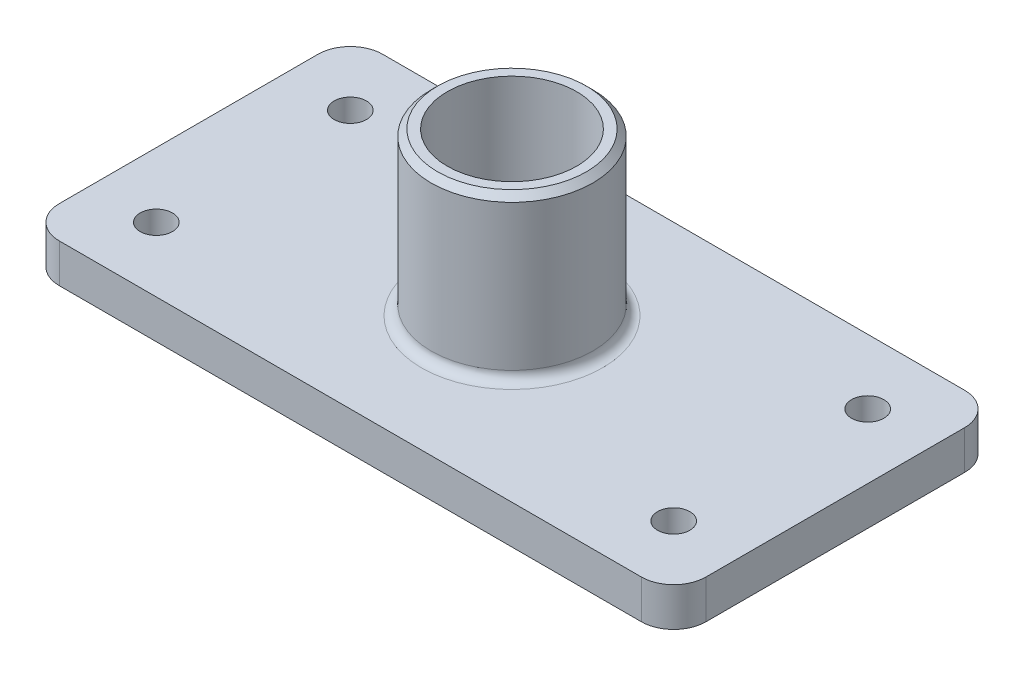
ISO-10303-21;
HEADER;
FILE_DESCRIPTION(('STEP AP214'),'2;1');
FILE_NAME('part.step','',(''),(''),'','','');
FILE_SCHEMA(('AUTOMOTIVE_DESIGN { 1 0 10303 214 1 1 1 1 }'));
ENDSEC;
DATA;
#1=APPLICATION_CONTEXT('core data for automotive mechanical design processes');
#2=APPLICATION_PROTOCOL_DEFINITION('international standard','automotive_design',2000,#1);
#3=PRODUCT_CONTEXT('',#1,'mechanical');
#4=PRODUCT('Part','Part','',(#3));
#5=PRODUCT_RELATED_PRODUCT_CATEGORY('part','',(#4));
#6=PRODUCT_DEFINITION_FORMATION('','',#4);
#7=PRODUCT_DEFINITION_CONTEXT('part definition',#1,'design');
#8=PRODUCT_DEFINITION('design','',#6,#7);
#9=PRODUCT_DEFINITION_SHAPE('','',#8);
#10=(LENGTH_UNIT() NAMED_UNIT(*) SI_UNIT(.MILLI.,.METRE.));
#11=(NAMED_UNIT(*) PLANE_ANGLE_UNIT() SI_UNIT($,.RADIAN.));
#12=(NAMED_UNIT(*) SI_UNIT($,.STERADIAN.) SOLID_ANGLE_UNIT());
#13=UNCERTAINTY_MEASURE_WITH_UNIT(LENGTH_MEASURE(1.E-05),#10,'distance_accuracy_value','');
#14=(GEOMETRIC_REPRESENTATION_CONTEXT(3) GLOBAL_UNCERTAINTY_ASSIGNED_CONTEXT((#13)) GLOBAL_UNIT_ASSIGNED_CONTEXT((#10,
#11,#12)) REPRESENTATION_CONTEXT('',''));
#15=CARTESIAN_POINT('',(0.,0.,0.));
#16=DIRECTION('',(0.,0.,1.));
#17=DIRECTION('',(1.,0.,0.));
#18=AXIS2_PLACEMENT_3D('',#15,#16,#17);
#19=CARTESIAN_POINT('',(90.,12.,40.));
#20=DIRECTION('',(0.,1.,0.));
#21=DIRECTION('',(0.,0.,1.));
#22=AXIS2_PLACEMENT_3D('',#19,#20,#21);
#23=PLANE('',#22);
#24=CARTESIAN_POINT('',(0.,12.,0.));
#25=DIRECTION('',(0.,1.,0.));
#26=DIRECTION('',(0.,0.,1.));
#27=AXIS2_PLACEMENT_3D('',#24,#25,#26);
#28=CIRCLE('',#27,28.);
#29=CARTESIAN_POINT('',(0.,12.,28.));
#30=VERTEX_POINT('',#29);
#31=EDGE_CURVE('E175',#30,#30,#28,.F.);
#32=ORIENTED_EDGE('',*,*,#31,.T.);
#33=EDGE_LOOP('',(#32));
#34=FACE_BOUND('',#33,.T.);
#35=CARTESIAN_POINT('',(80.,12.,30.));
#36=DIRECTION('',(0.,1.,0.));
#37=DIRECTION('',(0.,0.,1.));
#38=AXIS2_PLACEMENT_3D('',#35,#36,#37);
#39=CIRCLE('',#38,5.);
#40=CARTESIAN_POINT('',(80.,12.,35.));
#41=VERTEX_POINT('',#40);
#42=EDGE_CURVE('E265',#41,#41,#39,.T.);
#43=ORIENTED_EDGE('',*,*,#42,.F.);
#44=EDGE_LOOP('',(#43));
#45=FACE_BOUND('',#44,.T.);
#46=CARTESIAN_POINT('',(-80.,12.,-30.));
#47=DIRECTION('',(0.,1.,0.));
#48=DIRECTION('',(0.,0.,1.));
#49=AXIS2_PLACEMENT_3D('',#46,#47,#48);
#50=CIRCLE('',#49,4.99999999999999);
#51=CARTESIAN_POINT('',(-80.,12.,-25.));
#52=VERTEX_POINT('',#51);
#53=EDGE_CURVE('E253',#52,#52,#50,.T.);
#54=ORIENTED_EDGE('',*,*,#53,.F.);
#55=EDGE_LOOP('',(#54));
#56=FACE_BOUND('',#55,.T.);
#57=CARTESIAN_POINT('',(90.,12.,40.));
#58=DIRECTION('',(0.,1.,0.));
#59=DIRECTION('',(0.,0.,1.));
#60=AXIS2_PLACEMENT_3D('',#57,#58,#59);
#61=CIRCLE('',#60,10.);
#62=CARTESIAN_POINT('',(90.,12.,50.));
#63=VERTEX_POINT('',#62);
#64=CARTESIAN_POINT('',(100.,12.,40.));
#65=VERTEX_POINT('',#64);
#66=EDGE_CURVE('E157',#63,#65,#61,.T.);
#67=ORIENTED_EDGE('',*,*,#66,.T.);
#68=DIRECTION('',(0.,0.,-1.));
#69=VECTOR('',#68,1.);
#70=CARTESIAN_POINT('',(100.,12.,40.));
#71=LINE('',#70,#69);
#72=CARTESIAN_POINT('',(100.,12.,-40.));
#73=VERTEX_POINT('',#72);
#74=EDGE_CURVE('E105',#65,#73,#71,.T.);
#75=ORIENTED_EDGE('',*,*,#74,.T.);
#76=CARTESIAN_POINT('',(90.,12.,-40.));
#77=DIRECTION('',(0.,1.,0.));
#78=DIRECTION('',(0.,0.,-1.));
#79=AXIS2_PLACEMENT_3D('',#76,#77,#78);
#80=CIRCLE('',#79,9.99999999999998);
#81=CARTESIAN_POINT('',(90.,12.,-50.));
#82=VERTEX_POINT('',#81);
#83=EDGE_CURVE('E242',#73,#82,#80,.T.);
#84=ORIENTED_EDGE('',*,*,#83,.T.);
#85=DIRECTION('',(-1.,0.,0.));
#86=VECTOR('',#85,1.);
#87=CARTESIAN_POINT('',(-90.,12.,-50.));
#88=LINE('',#87,#86);
#89=CARTESIAN_POINT('',(-90.,12.,-50.));
#90=VERTEX_POINT('',#89);
#91=EDGE_CURVE('E244',#82,#90,#88,.T.);
#92=ORIENTED_EDGE('',*,*,#91,.T.);
#93=CARTESIAN_POINT('',(-90.,12.,-40.));
#94=DIRECTION('',(0.,1.,0.));
#95=DIRECTION('',(0.,0.,-1.));
#96=AXIS2_PLACEMENT_3D('',#93,#94,#95);
#97=CIRCLE('',#96,10.);
#98=CARTESIAN_POINT('',(-100.,12.,-40.));
#99=VERTEX_POINT('',#98);
#100=EDGE_CURVE('E124',#90,#99,#97,.T.);
#101=ORIENTED_EDGE('',*,*,#100,.T.);
#102=DIRECTION('',(0.,0.,1.));
#103=VECTOR('',#102,1.);
#104=CARTESIAN_POINT('',(-100.,12.,40.));
#105=LINE('',#104,#103);
#106=CARTESIAN_POINT('',(-100.,12.,40.));
#107=VERTEX_POINT('',#106);
#108=EDGE_CURVE('E118',#99,#107,#105,.T.);
#109=ORIENTED_EDGE('',*,*,#108,.T.);
#110=CARTESIAN_POINT('',(-90.,12.,40.));
#111=DIRECTION('',(0.,1.,0.));
#112=DIRECTION('',(0.,0.,-1.));
#113=AXIS2_PLACEMENT_3D('',#110,#111,#112);
#114=CIRCLE('',#113,10.);
#115=CARTESIAN_POINT('',(-90.,12.,50.));
#116=VERTEX_POINT('',#115);
#117=EDGE_CURVE('E122',#107,#116,#114,.T.);
#118=ORIENTED_EDGE('',*,*,#117,.T.);
#119=DIRECTION('',(1.,0.,0.));
#120=VECTOR('',#119,1.);
#121=CARTESIAN_POINT('',(-90.,12.,50.));
#122=LINE('',#121,#120);
#123=EDGE_CURVE('E61',#116,#63,#122,.T.);
#124=ORIENTED_EDGE('',*,*,#123,.T.);
#125=EDGE_LOOP('',(#67,#75,#84,#92,#101,#109,#118,#124));
#126=FACE_BOUND('',#125,.T.);
#127=CARTESIAN_POINT('',(-80.,12.,30.));
#128=DIRECTION('',(0.,1.,0.));
#129=DIRECTION('',(0.,0.,1.));
#130=AXIS2_PLACEMENT_3D('',#127,#128,#129);
#131=CIRCLE('',#130,4.99999999999999);
#132=CARTESIAN_POINT('',(-80.,12.,35.));
#133=VERTEX_POINT('',#132);
#134=EDGE_CURVE('E146',#133,#133,#131,.T.);
#135=ORIENTED_EDGE('',*,*,#134,.F.);
#136=EDGE_LOOP('',(#135));
#137=FACE_BOUND('',#136,.T.);
#138=CARTESIAN_POINT('',(80.,12.,-30.));
#139=DIRECTION('',(0.,1.,0.));
#140=DIRECTION('',(0.,0.,1.));
#141=AXIS2_PLACEMENT_3D('',#138,#139,#140);
#142=CIRCLE('',#141,5.);
#143=CARTESIAN_POINT('',(80.,12.,-25.));
#144=VERTEX_POINT('',#143);
#145=EDGE_CURVE('E259',#144,#144,#142,.T.);
#146=ORIENTED_EDGE('',*,*,#145,.F.);
#147=EDGE_LOOP('',(#146));
#148=FACE_BOUND('',#147,.T.);
#149=ADVANCED_FACE('F44',(#34,#45,#56,#126,#137,#148),#23,.T.);
#150=CARTESIAN_POINT('',(90.,0.,40.));
#151=DIRECTION('',(0.,1.,0.));
#152=DIRECTION('',(0.,0.,1.));
#153=AXIS2_PLACEMENT_3D('',#150,#151,#152);
#154=PLANE('',#153);
#155=CARTESIAN_POINT('',(0.,0.,0.));
#156=DIRECTION('',(0.,1.,0.));
#157=DIRECTION('',(0.,0.,1.));
#158=AXIS2_PLACEMENT_3D('',#155,#156,#157);
#159=CIRCLE('',#158,20.);
#160=CARTESIAN_POINT('',(0.,0.,20.));
#161=VERTEX_POINT('',#160);
#162=EDGE_CURVE('E271',#161,#161,#159,.T.);
#163=ORIENTED_EDGE('',*,*,#162,.T.);
#164=EDGE_LOOP('',(#163));
#165=FACE_BOUND('',#164,.T.);
#166=CARTESIAN_POINT('',(80.,0.,-30.));
#167=DIRECTION('',(0.,1.,0.));
#168=DIRECTION('',(0.,0.,1.));
#169=AXIS2_PLACEMENT_3D('',#166,#167,#168);
#170=CIRCLE('',#169,5.);
#171=CARTESIAN_POINT('',(80.,0.,-25.));
#172=VERTEX_POINT('',#171);
#173=EDGE_CURVE('E262',#172,#172,#170,.T.);
#174=ORIENTED_EDGE('',*,*,#173,.T.);
#175=EDGE_LOOP('',(#174));
#176=FACE_BOUND('',#175,.T.);
#177=CARTESIAN_POINT('',(-80.,0.,30.));
#178=DIRECTION('',(0.,1.,0.));
#179=DIRECTION('',(0.,0.,1.));
#180=AXIS2_PLACEMENT_3D('',#177,#178,#179);
#181=CIRCLE('',#180,4.99999999999999);
#182=CARTESIAN_POINT('',(-80.,0.,35.));
#183=VERTEX_POINT('',#182);
#184=EDGE_CURVE('E250',#183,#183,#181,.T.);
#185=ORIENTED_EDGE('',*,*,#184,.T.);
#186=EDGE_LOOP('',(#185));
#187=FACE_BOUND('',#186,.T.);
#188=CARTESIAN_POINT('',(90.,0.,40.));
#189=DIRECTION('',(0.,1.,0.));
#190=DIRECTION('',(0.,0.,1.));
#191=AXIS2_PLACEMENT_3D('',#188,#189,#190);
#192=CIRCLE('',#191,10.);
#193=CARTESIAN_POINT('',(90.,0.,50.));
#194=VERTEX_POINT('',#193);
#195=CARTESIAN_POINT('',(100.,0.,40.));
#196=VERTEX_POINT('',#195);
#197=EDGE_CURVE('E142',#194,#196,#192,.T.);
#198=ORIENTED_EDGE('',*,*,#197,.F.);
#199=DIRECTION('',(1.,0.,0.));
#200=VECTOR('',#199,1.);
#201=CARTESIAN_POINT('',(-90.,0.,50.));
#202=LINE('',#201,#200);
#203=CARTESIAN_POINT('',(-90.,0.,50.));
#204=VERTEX_POINT('',#203);
#205=EDGE_CURVE('E96',#204,#194,#202,.T.);
#206=ORIENTED_EDGE('',*,*,#205,.F.);
#207=CARTESIAN_POINT('',(-90.,0.,40.));
#208=DIRECTION('',(0.,1.,0.));
#209=DIRECTION('',(0.,0.,-1.));
#210=AXIS2_PLACEMENT_3D('',#207,#208,#209);
#211=CIRCLE('',#210,10.);
#212=CARTESIAN_POINT('',(-100.,0.,40.));
#213=VERTEX_POINT('',#212);
#214=EDGE_CURVE('E90',#213,#204,#211,.T.);
#215=ORIENTED_EDGE('',*,*,#214,.F.);
#216=DIRECTION('',(0.,0.,1.));
#217=VECTOR('',#216,1.);
#218=CARTESIAN_POINT('',(-100.,0.,40.));
#219=LINE('',#218,#217);
#220=CARTESIAN_POINT('',(-100.,0.,-40.));
#221=VERTEX_POINT('',#220);
#222=EDGE_CURVE('E132',#221,#213,#219,.T.);
#223=ORIENTED_EDGE('',*,*,#222,.F.);
#224=CARTESIAN_POINT('',(-90.,0.,-40.));
#225=DIRECTION('',(0.,1.,0.));
#226=DIRECTION('',(0.,0.,-1.));
#227=AXIS2_PLACEMENT_3D('',#224,#225,#226);
#228=CIRCLE('',#227,10.);
#229=CARTESIAN_POINT('',(-90.,0.,-50.));
#230=VERTEX_POINT('',#229);
#231=EDGE_CURVE('E152',#230,#221,#228,.T.);
#232=ORIENTED_EDGE('',*,*,#231,.F.);
#233=DIRECTION('',(-1.,0.,0.));
#234=VECTOR('',#233,1.);
#235=CARTESIAN_POINT('',(-90.,0.,-50.));
#236=LINE('',#235,#234);
#237=CARTESIAN_POINT('',(90.,0.,-50.));
#238=VERTEX_POINT('',#237);
#239=EDGE_CURVE('E150',#238,#230,#236,.T.);
#240=ORIENTED_EDGE('',*,*,#239,.F.);
#241=CARTESIAN_POINT('',(90.,0.,-40.));
#242=DIRECTION('',(0.,1.,0.));
#243=DIRECTION('',(0.,0.,-1.));
#244=AXIS2_PLACEMENT_3D('',#241,#242,#243);
#245=CIRCLE('',#244,9.99999999999998);
#246=CARTESIAN_POINT('',(100.,0.,-40.));
#247=VERTEX_POINT('',#246);
#248=EDGE_CURVE('E148',#247,#238,#245,.T.);
#249=ORIENTED_EDGE('',*,*,#248,.F.);
#250=DIRECTION('',(0.,0.,-1.));
#251=VECTOR('',#250,1.);
#252=CARTESIAN_POINT('',(100.,0.,40.));
#253=LINE('',#252,#251);
#254=EDGE_CURVE('E145',#196,#247,#253,.T.);
#255=ORIENTED_EDGE('',*,*,#254,.F.);
#256=EDGE_LOOP('',(#198,#206,#215,#223,#232,#240,#249,#255));
#257=FACE_BOUND('',#256,.T.);
#258=CARTESIAN_POINT('',(-80.,0.,-30.));
#259=DIRECTION('',(0.,1.,0.));
#260=DIRECTION('',(0.,0.,1.));
#261=AXIS2_PLACEMENT_3D('',#258,#259,#260);
#262=CIRCLE('',#261,4.99999999999999);
#263=CARTESIAN_POINT('',(-80.,0.,-25.));
#264=VERTEX_POINT('',#263);
#265=EDGE_CURVE('E256',#264,#264,#262,.T.);
#266=ORIENTED_EDGE('',*,*,#265,.T.);
#267=EDGE_LOOP('',(#266));
#268=FACE_BOUND('',#267,.T.);
#269=CARTESIAN_POINT('',(80.,0.,30.));
#270=DIRECTION('',(0.,1.,0.));
#271=DIRECTION('',(0.,0.,1.));
#272=AXIS2_PLACEMENT_3D('',#269,#270,#271);
#273=CIRCLE('',#272,5.);
#274=CARTESIAN_POINT('',(80.,0.,35.));
#275=VERTEX_POINT('',#274);
#276=EDGE_CURVE('E268',#275,#275,#273,.T.);
#277=ORIENTED_EDGE('',*,*,#276,.T.);
#278=EDGE_LOOP('',(#277));
#279=FACE_BOUND('',#278,.T.);
#280=ADVANCED_FACE('F193',(#165,#176,#187,#257,#268,#279),#154,.F.);
#281=CARTESIAN_POINT('',(90.,12.,40.));
#282=DIRECTION('',(0.,-1.,0.));
#283=DIRECTION('',(0.,0.,-1.));
#284=AXIS2_PLACEMENT_3D('',#281,#282,#283);
#285=CYLINDRICAL_SURFACE('',#284,10.);
#286=ORIENTED_EDGE('',*,*,#197,.T.);
#287=DIRECTION('',(0.,-1.,0.));
#288=VECTOR('',#287,1.);
#289=CARTESIAN_POINT('',(100.,12.,40.));
#290=LINE('',#289,#288);
#291=EDGE_CURVE('E170',#65,#196,#290,.T.);
#292=ORIENTED_EDGE('',*,*,#291,.F.);
#293=ORIENTED_EDGE('',*,*,#66,.F.);
#294=DIRECTION('',(0.,-1.,0.));
#295=VECTOR('',#294,1.);
#296=CARTESIAN_POINT('',(90.,12.,50.));
#297=LINE('',#296,#295);
#298=EDGE_CURVE('E138',#63,#194,#297,.T.);
#299=ORIENTED_EDGE('',*,*,#298,.T.);
#300=EDGE_LOOP('',(#286,#292,#293,#299));
#301=FACE_BOUND('',#300,.T.);
#302=ADVANCED_FACE('F199',(#301),#285,.T.);
#303=CARTESIAN_POINT('',(100.,12.,40.));
#304=DIRECTION('',(-1.,0.,0.));
#305=DIRECTION('',(0.,0.,1.));
#306=AXIS2_PLACEMENT_3D('',#303,#304,#305);
#307=PLANE('',#306);
#308=ORIENTED_EDGE('',*,*,#254,.T.);
#309=DIRECTION('',(0.,-1.,0.));
#310=VECTOR('',#309,1.);
#311=CARTESIAN_POINT('',(100.,12.,-40.));
#312=LINE('',#311,#310);
#313=EDGE_CURVE('E167',#73,#247,#312,.T.);
#314=ORIENTED_EDGE('',*,*,#313,.F.);
#315=ORIENTED_EDGE('',*,*,#74,.F.);
#316=ORIENTED_EDGE('',*,*,#291,.T.);
#317=EDGE_LOOP('',(#308,#314,#315,#316));
#318=FACE_BOUND('',#317,.T.);
#319=ADVANCED_FACE('F225',(#318),#307,.F.);
#320=CARTESIAN_POINT('',(90.,12.,-40.));
#321=DIRECTION('',(0.,-1.,0.));
#322=DIRECTION('',(0.,0.,-1.));
#323=AXIS2_PLACEMENT_3D('',#320,#321,#322);
#324=CYLINDRICAL_SURFACE('',#323,9.99999999999998);
#325=ORIENTED_EDGE('',*,*,#248,.T.);
#326=DIRECTION('',(0.,-1.,0.));
#327=VECTOR('',#326,1.);
#328=CARTESIAN_POINT('',(90.,12.,-50.));
#329=LINE('',#328,#327);
#330=EDGE_CURVE('E164',#82,#238,#329,.T.);
#331=ORIENTED_EDGE('',*,*,#330,.F.);
#332=ORIENTED_EDGE('',*,*,#83,.F.);
#333=ORIENTED_EDGE('',*,*,#313,.T.);
#334=EDGE_LOOP('',(#325,#331,#332,#333));
#335=FACE_BOUND('',#334,.T.);
#336=ADVANCED_FACE('F221',(#335),#324,.T.);
#337=CARTESIAN_POINT('',(-90.,12.,-50.));
#338=DIRECTION('',(0.,0.,1.));
#339=DIRECTION('',(1.,0.,0.));
#340=AXIS2_PLACEMENT_3D('',#337,#338,#339);
#341=PLANE('',#340);
#342=ORIENTED_EDGE('',*,*,#239,.T.);
#343=DIRECTION('',(0.,-1.,0.));
#344=VECTOR('',#343,1.);
#345=CARTESIAN_POINT('',(-90.,12.,-50.));
#346=LINE('',#345,#344);
#347=EDGE_CURVE('E161',#90,#230,#346,.T.);
#348=ORIENTED_EDGE('',*,*,#347,.F.);
#349=ORIENTED_EDGE('',*,*,#91,.F.);
#350=ORIENTED_EDGE('',*,*,#330,.T.);
#351=EDGE_LOOP('',(#342,#348,#349,#350));
#352=FACE_BOUND('',#351,.T.);
#353=ADVANCED_FACE('F217',(#352),#341,.F.);
#354=CARTESIAN_POINT('',(-90.,12.,-40.));
#355=DIRECTION('',(0.,-1.,0.));
#356=DIRECTION('',(0.,0.,-1.));
#357=AXIS2_PLACEMENT_3D('',#354,#355,#356);
#358=CYLINDRICAL_SURFACE('',#357,10.);
#359=ORIENTED_EDGE('',*,*,#231,.T.);
#360=DIRECTION('',(0.,-1.,0.));
#361=VECTOR('',#360,1.);
#362=CARTESIAN_POINT('',(-100.,12.,-40.));
#363=LINE('',#362,#361);
#364=EDGE_CURVE('E133',#99,#221,#363,.T.);
#365=ORIENTED_EDGE('',*,*,#364,.F.);
#366=ORIENTED_EDGE('',*,*,#100,.F.);
#367=ORIENTED_EDGE('',*,*,#347,.T.);
#368=EDGE_LOOP('',(#359,#365,#366,#367));
#369=FACE_BOUND('',#368,.T.);
#370=ADVANCED_FACE('F214',(#369),#358,.T.);
#371=CARTESIAN_POINT('',(-100.,12.,40.));
#372=DIRECTION('',(1.,0.,0.));
#373=DIRECTION('',(0.,0.,-1.));
#374=AXIS2_PLACEMENT_3D('',#371,#372,#373);
#375=PLANE('',#374);
#376=ORIENTED_EDGE('',*,*,#222,.T.);
#377=DIRECTION('',(0.,-1.,0.));
#378=VECTOR('',#377,1.);
#379=CARTESIAN_POINT('',(-100.,12.,40.));
#380=LINE('',#379,#378);
#381=EDGE_CURVE('E129',#107,#213,#380,.T.);
#382=ORIENTED_EDGE('',*,*,#381,.F.);
#383=ORIENTED_EDGE('',*,*,#108,.F.);
#384=ORIENTED_EDGE('',*,*,#364,.T.);
#385=EDGE_LOOP('',(#376,#382,#383,#384));
#386=FACE_BOUND('',#385,.T.);
#387=ADVANCED_FACE('F130',(#386),#375,.F.);
#388=CARTESIAN_POINT('',(-90.,12.,40.));
#389=DIRECTION('',(0.,-1.,0.));
#390=DIRECTION('',(0.,0.,-1.));
#391=AXIS2_PLACEMENT_3D('',#388,#389,#390);
#392=CYLINDRICAL_SURFACE('',#391,10.);
#393=ORIENTED_EDGE('',*,*,#214,.T.);
#394=DIRECTION('',(0.,-1.,0.));
#395=VECTOR('',#394,1.);
#396=CARTESIAN_POINT('',(-90.,12.,50.));
#397=LINE('',#396,#395);
#398=EDGE_CURVE('E134',#116,#204,#397,.T.);
#399=ORIENTED_EDGE('',*,*,#398,.F.);
#400=ORIENTED_EDGE('',*,*,#117,.F.);
#401=ORIENTED_EDGE('',*,*,#381,.T.);
#402=EDGE_LOOP('',(#393,#399,#400,#401));
#403=FACE_BOUND('',#402,.T.);
#404=ADVANCED_FACE('F136',(#403),#392,.T.);
#405=CARTESIAN_POINT('',(-90.,12.,50.));
#406=DIRECTION('',(0.,0.,-1.));
#407=DIRECTION('',(-1.,0.,0.));
#408=AXIS2_PLACEMENT_3D('',#405,#406,#407);
#409=PLANE('',#408);
#410=ORIENTED_EDGE('',*,*,#205,.T.);
#411=ORIENTED_EDGE('',*,*,#298,.F.);
#412=ORIENTED_EDGE('',*,*,#123,.F.);
#413=ORIENTED_EDGE('',*,*,#398,.T.);
#414=EDGE_LOOP('',(#410,#411,#412,#413));
#415=FACE_BOUND('',#414,.T.);
#416=ADVANCED_FACE('F207',(#415),#409,.F.);
#417=CARTESIAN_POINT('',(-80.,12.,30.));
#418=DIRECTION('',(0.,-1.,0.));
#419=DIRECTION('',(0.,0.,-1.));
#420=AXIS2_PLACEMENT_3D('',#417,#418,#419);
#421=CYLINDRICAL_SURFACE('',#420,4.99999999999999);
#422=ORIENTED_EDGE('',*,*,#134,.T.);
#423=EDGE_LOOP('',(#422));
#424=FACE_BOUND('',#423,.T.);
#425=ORIENTED_EDGE('',*,*,#184,.F.);
#426=EDGE_LOOP('',(#425));
#427=FACE_BOUND('',#426,.T.);
#428=ADVANCED_FACE('F204',(#424,#427),#421,.F.);
#429=CARTESIAN_POINT('',(-80.,12.,-30.));
#430=DIRECTION('',(0.,-1.,0.));
#431=DIRECTION('',(0.,0.,-1.));
#432=AXIS2_PLACEMENT_3D('',#429,#430,#431);
#433=CYLINDRICAL_SURFACE('',#432,4.99999999999999);
#434=ORIENTED_EDGE('',*,*,#53,.T.);
#435=EDGE_LOOP('',(#434));
#436=FACE_BOUND('',#435,.T.);
#437=ORIENTED_EDGE('',*,*,#265,.F.);
#438=EDGE_LOOP('',(#437));
#439=FACE_BOUND('',#438,.T.);
#440=ADVANCED_FACE('F300',(#436,#439),#433,.F.);
#441=CARTESIAN_POINT('',(80.,12.,-30.));
#442=DIRECTION('',(0.,-1.,0.));
#443=DIRECTION('',(0.,0.,-1.));
#444=AXIS2_PLACEMENT_3D('',#441,#442,#443);
#445=CYLINDRICAL_SURFACE('',#444,5.);
#446=ORIENTED_EDGE('',*,*,#145,.T.);
#447=EDGE_LOOP('',(#446));
#448=FACE_BOUND('',#447,.T.);
#449=ORIENTED_EDGE('',*,*,#173,.F.);
#450=EDGE_LOOP('',(#449));
#451=FACE_BOUND('',#450,.T.);
#452=ADVANCED_FACE('F297',(#448,#451),#445,.F.);
#453=CARTESIAN_POINT('',(80.,12.,30.));
#454=DIRECTION('',(0.,-1.,0.));
#455=DIRECTION('',(0.,0.,-1.));
#456=AXIS2_PLACEMENT_3D('',#453,#454,#455);
#457=CYLINDRICAL_SURFACE('',#456,5.);
#458=ORIENTED_EDGE('',*,*,#42,.T.);
#459=EDGE_LOOP('',(#458));
#460=FACE_BOUND('',#459,.T.);
#461=ORIENTED_EDGE('',*,*,#276,.F.);
#462=EDGE_LOOP('',(#461));
#463=FACE_BOUND('',#462,.T.);
#464=ADVANCED_FACE('F291',(#460,#463),#457,.F.);
#465=CARTESIAN_POINT('',(0.,62.,0.));
#466=DIRECTION('',(0.,-1.,0.));
#467=DIRECTION('',(0.,0.,-1.));
#468=AXIS2_PLACEMENT_3D('',#465,#466,#467);
#469=CYLINDRICAL_SURFACE('',#468,25.);
#470=CARTESIAN_POINT('',(0.,60.,0.));
#471=DIRECTION('',(0.,1.,0.));
#472=DIRECTION('',(0.,0.,1.));
#473=AXIS2_PLACEMENT_3D('',#470,#471,#472);
#474=CIRCLE('',#473,25.);
#475=CARTESIAN_POINT('',(0.,60.,25.));
#476=VERTEX_POINT('',#475);
#477=EDGE_CURVE('E13',#476,#476,#474,.F.);
#478=ORIENTED_EDGE('',*,*,#477,.T.);
#479=EDGE_LOOP('',(#478));
#480=FACE_BOUND('',#479,.T.);
#481=CARTESIAN_POINT('',(0.,15.,0.));
#482=DIRECTION('',(0.,1.,0.));
#483=DIRECTION('',(0.,0.,1.));
#484=AXIS2_PLACEMENT_3D('',#481,#482,#483);
#485=CIRCLE('',#484,25.);
#486=CARTESIAN_POINT('',(0.,15.,25.));
#487=VERTEX_POINT('',#486);
#488=EDGE_CURVE('E172',#487,#487,#485,.T.);
#489=ORIENTED_EDGE('',*,*,#488,.T.);
#490=EDGE_LOOP('',(#489));
#491=FACE_BOUND('',#490,.T.);
#492=ADVANCED_FACE('F286',(#480,#491),#469,.T.);
#493=CARTESIAN_POINT('',(0.,62.,0.));
#494=DIRECTION('',(0.,1.,0.));
#495=DIRECTION('',(0.,0.,1.));
#496=AXIS2_PLACEMENT_3D('',#493,#494,#495);
#497=PLANE('',#496);
#498=CARTESIAN_POINT('',(0.,62.,0.));
#499=DIRECTION('',(0.,1.,0.));
#500=DIRECTION('',(0.,0.,1.));
#501=AXIS2_PLACEMENT_3D('',#498,#499,#500);
#502=CIRCLE('',#501,23.);
#503=CARTESIAN_POINT('',(0.,62.,23.));
#504=VERTEX_POINT('',#503);
#505=EDGE_CURVE('E53',#504,#504,#502,.T.);
#506=ORIENTED_EDGE('',*,*,#505,.T.);
#507=EDGE_LOOP('',(#506));
#508=FACE_BOUND('',#507,.T.);
#509=CARTESIAN_POINT('',(0.,62.,0.));
#510=DIRECTION('',(0.,1.,0.));
#511=DIRECTION('',(0.,0.,1.));
#512=AXIS2_PLACEMENT_3D('',#509,#510,#511);
#513=CIRCLE('',#512,20.);
#514=CARTESIAN_POINT('',(0.,62.,20.));
#515=VERTEX_POINT('',#514);
#516=EDGE_CURVE('E274',#515,#515,#513,.T.);
#517=ORIENTED_EDGE('',*,*,#516,.F.);
#518=EDGE_LOOP('',(#517));
#519=FACE_BOUND('',#518,.T.);
#520=ADVANCED_FACE('F180',(#508,#519),#497,.T.);
#521=CARTESIAN_POINT('',(0.,0.,0.));
#522=DIRECTION('',(0.,1.,0.));
#523=DIRECTION('',(0.,0.,1.));
#524=AXIS2_PLACEMENT_3D('',#521,#522,#523);
#525=CYLINDRICAL_SURFACE('',#524,20.);
#526=ORIENTED_EDGE('',*,*,#162,.F.);
#527=EDGE_LOOP('',(#526));
#528=FACE_BOUND('',#527,.T.);
#529=ORIENTED_EDGE('',*,*,#516,.T.);
#530=EDGE_LOOP('',(#529));
#531=FACE_BOUND('',#530,.T.);
#532=ADVANCED_FACE('F189',(#528,#531),#525,.F.);
#533=CARTESIAN_POINT('',(0.,15.,0.));
#534=DIRECTION('',(0.,1.,0.));
#535=DIRECTION('',(0.,0.,1.));
#536=AXIS2_PLACEMENT_3D('',#533,#534,#535);
#537=TOROIDAL_SURFACE('',#536,28.,3.);
#538=ORIENTED_EDGE('',*,*,#31,.F.);
#539=EDGE_LOOP('',(#538));
#540=FACE_BOUND('',#539,.T.);
#541=ORIENTED_EDGE('',*,*,#488,.F.);
#542=EDGE_LOOP('',(#541));
#543=FACE_BOUND('',#542,.T.);
#544=ADVANCED_FACE('F184',(#540,#543),#537,.F.);
#545=CARTESIAN_POINT('',(0.,62.,0.));
#546=DIRECTION('',(0.,-1.,0.));
#547=DIRECTION('',(0.,0.,-1.));
#548=AXIS2_PLACEMENT_3D('',#545,#546,#547);
#549=CONICAL_SURFACE('',#548,23.,0.785398163397447);
#550=ORIENTED_EDGE('',*,*,#477,.F.);
#551=EDGE_LOOP('',(#550));
#552=FACE_BOUND('',#551,.T.);
#553=ORIENTED_EDGE('',*,*,#505,.F.);
#554=EDGE_LOOP('',(#553));
#555=FACE_BOUND('',#554,.T.);
#556=ADVANCED_FACE('F46',(#552,#555),#549,.T.);
#557=CLOSED_SHELL('',(#149,#280,#302,#319,#336,#353,#370,#387,#404,#416,#428,#440,#452,#464,
#492,#520,#532,#544,#556));
#558=MANIFOLD_SOLID_BREP('B2',#557);
#559=ADVANCED_BREP_SHAPE_REPRESENTATION('',(#18,#558),#14);
#560=SHAPE_DEFINITION_REPRESENTATION(#9,#559);
ENDSEC;
END-ISO-10303-21;
